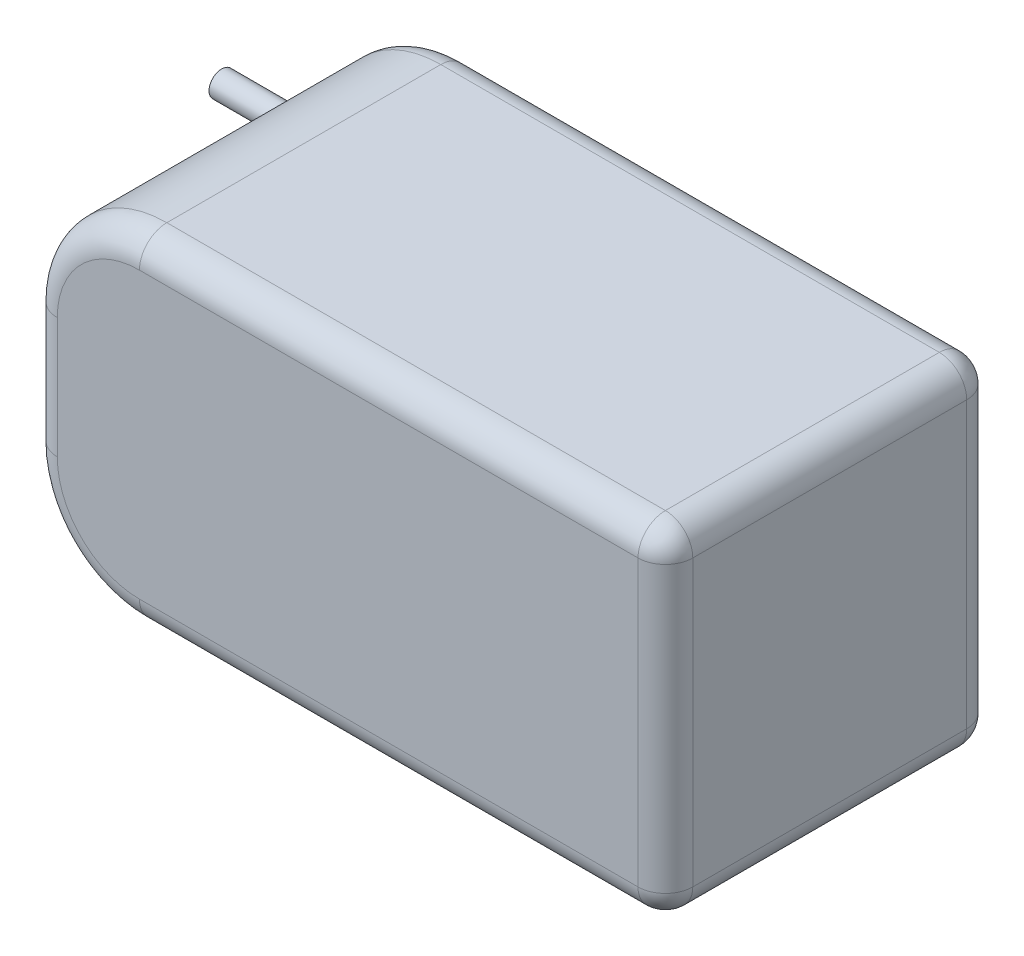
ISO-10303-21;
HEADER;
FILE_DESCRIPTION(('STEP AP214'),'2;1');
FILE_NAME('part.step','',(''),(''),'','','');
FILE_SCHEMA(('AUTOMOTIVE_DESIGN { 1 0 10303 214 1 1 1 1 }'));
ENDSEC;
DATA;
#1=APPLICATION_CONTEXT('core data for automotive mechanical design processes');
#2=APPLICATION_PROTOCOL_DEFINITION('international standard','automotive_design',2000,#1);
#3=PRODUCT_CONTEXT('',#1,'mechanical');
#4=PRODUCT('Part','Part','',(#3));
#5=PRODUCT_RELATED_PRODUCT_CATEGORY('part','',(#4));
#6=PRODUCT_DEFINITION_FORMATION('','',#4);
#7=PRODUCT_DEFINITION_CONTEXT('part definition',#1,'design');
#8=PRODUCT_DEFINITION('design','',#6,#7);
#9=PRODUCT_DEFINITION_SHAPE('','',#8);
#10=(LENGTH_UNIT() NAMED_UNIT(*) SI_UNIT(.MILLI.,.METRE.));
#11=(NAMED_UNIT(*) PLANE_ANGLE_UNIT() SI_UNIT($,.RADIAN.));
#12=(NAMED_UNIT(*) SI_UNIT($,.STERADIAN.) SOLID_ANGLE_UNIT());
#13=UNCERTAINTY_MEASURE_WITH_UNIT(LENGTH_MEASURE(1.E-05),#10,'distance_accuracy_value','');
#14=(GEOMETRIC_REPRESENTATION_CONTEXT(3) GLOBAL_UNCERTAINTY_ASSIGNED_CONTEXT((#13)) GLOBAL_UNIT_ASSIGNED_CONTEXT((#10,
#11,#12)) REPRESENTATION_CONTEXT('',''));
#15=CARTESIAN_POINT('',(0.,0.,0.));
#16=DIRECTION('',(0.,0.,1.));
#17=DIRECTION('',(1.,0.,0.));
#18=AXIS2_PLACEMENT_3D('',#15,#16,#17);
#19=CARTESIAN_POINT('',(29.,31.,-15.));
#20=DIRECTION('',(-1.,0.,0.));
#21=DIRECTION('',(0.,0.,1.));
#22=AXIS2_PLACEMENT_3D('',#19,#20,#21);
#23=PLANE('',#22);
#24=DIRECTION('',(0.,-1.,0.));
#25=VECTOR('',#24,1.);
#26=CARTESIAN_POINT('',(29.,31.,12.5));
#27=LINE('',#26,#25);
#28=CARTESIAN_POINT('',(29.,28.5,12.5));
#29=VERTEX_POINT('',#28);
#30=CARTESIAN_POINT('',(29.,2.5,12.5));
#31=VERTEX_POINT('',#30);
#32=EDGE_CURVE('E236',#29,#31,#27,.T.);
#33=ORIENTED_EDGE('',*,*,#32,.T.);
#34=DIRECTION('',(0.,0.,-1.));
#35=VECTOR('',#34,1.);
#36=CARTESIAN_POINT('',(29.,2.5,-15.));
#37=LINE('',#36,#35);
#38=CARTESIAN_POINT('',(29.,2.5,-12.5));
#39=VERTEX_POINT('',#38);
#40=EDGE_CURVE('E239',#31,#39,#37,.T.);
#41=ORIENTED_EDGE('',*,*,#40,.T.);
#42=DIRECTION('',(0.,-1.,0.));
#43=VECTOR('',#42,1.);
#44=CARTESIAN_POINT('',(29.,31.,-12.5));
#45=LINE('',#44,#43);
#46=CARTESIAN_POINT('',(29.,28.5,-12.5));
#47=VERTEX_POINT('',#46);
#48=EDGE_CURVE('E234',#39,#47,#45,.F.);
#49=ORIENTED_EDGE('',*,*,#48,.T.);
#50=DIRECTION('',(0.,0.,-1.));
#51=VECTOR('',#50,1.);
#52=CARTESIAN_POINT('',(29.,28.5,15.));
#53=LINE('',#52,#51);
#54=EDGE_CURVE('E232',#47,#29,#53,.F.);
#55=ORIENTED_EDGE('',*,*,#54,.T.);
#56=EDGE_LOOP('',(#33,#41,#49,#55));
#57=FACE_BOUND('',#56,.T.);
#58=ADVANCED_FACE('F34',(#57),#23,.F.);
#59=CARTESIAN_POINT('',(-29.,31.,-15.));
#60=DIRECTION('',(0.,0.,1.));
#61=DIRECTION('',(1.,0.,0.));
#62=AXIS2_PLACEMENT_3D('',#59,#60,#61);
#63=PLANE('',#62);
#64=DIRECTION('',(0.,-1.,0.));
#65=VECTOR('',#64,1.);
#66=CARTESIAN_POINT('',(26.5,31.,-15.));
#67=LINE('',#66,#65);
#68=CARTESIAN_POINT('',(26.5,28.5,-15.));
#69=VERTEX_POINT('',#68);
#70=CARTESIAN_POINT('',(26.5,2.5,-15.));
#71=VERTEX_POINT('',#70);
#72=EDGE_CURVE('E221',#69,#71,#67,.T.);
#73=ORIENTED_EDGE('',*,*,#72,.T.);
#74=DIRECTION('',(-1.,0.,0.));
#75=VECTOR('',#74,1.);
#76=CARTESIAN_POINT('',(-29.,2.5,-15.));
#77=LINE('',#76,#75);
#78=CARTESIAN_POINT('',(-19.,2.5,-15.));
#79=VERTEX_POINT('',#78);
#80=EDGE_CURVE('E229',#71,#79,#77,.T.);
#81=ORIENTED_EDGE('',*,*,#80,.T.);
#82=CARTESIAN_POINT('',(-19.,10.,-15.));
#83=DIRECTION('',(0.,0.,1.));
#84=DIRECTION('',(1.,0.,0.));
#85=AXIS2_PLACEMENT_3D('',#82,#83,#84);
#86=CIRCLE('',#85,7.5);
#87=CARTESIAN_POINT('',(-26.5,10.,-15.));
#88=VERTEX_POINT('',#87);
#89=EDGE_CURVE('E227',#79,#88,#86,.F.);
#90=ORIENTED_EDGE('',*,*,#89,.T.);
#91=DIRECTION('',(0.,-1.,0.));
#92=VECTOR('',#91,1.);
#93=CARTESIAN_POINT('',(-26.5,31.,-15.));
#94=LINE('',#93,#92);
#95=CARTESIAN_POINT('',(-26.5,21.,-15.));
#96=VERTEX_POINT('',#95);
#97=EDGE_CURVE('E225',#88,#96,#94,.F.);
#98=ORIENTED_EDGE('',*,*,#97,.T.);
#99=CARTESIAN_POINT('',(-19.,21.,-15.));
#100=DIRECTION('',(0.,0.,1.));
#101=DIRECTION('',(1.,0.,0.));
#102=AXIS2_PLACEMENT_3D('',#99,#100,#101);
#103=CIRCLE('',#102,7.5);
#104=CARTESIAN_POINT('',(-19.,28.5,-15.));
#105=VERTEX_POINT('',#104);
#106=EDGE_CURVE('E223',#96,#105,#103,.F.);
#107=ORIENTED_EDGE('',*,*,#106,.T.);
#108=DIRECTION('',(-1.,0.,0.));
#109=VECTOR('',#108,1.);
#110=CARTESIAN_POINT('',(29.,28.5,-15.));
#111=LINE('',#110,#109);
#112=EDGE_CURVE('E219',#105,#69,#111,.F.);
#113=ORIENTED_EDGE('',*,*,#112,.T.);
#114=EDGE_LOOP('',(#73,#81,#90,#98,#107,#113));
#115=FACE_BOUND('',#114,.T.);
#116=ADVANCED_FACE('F356',(#115),#63,.F.);
#117=CARTESIAN_POINT('',(-29.,31.,-15.));
#118=DIRECTION('',(1.,0.,0.));
#119=DIRECTION('',(0.,0.,-1.));
#120=AXIS2_PLACEMENT_3D('',#117,#118,#119);
#121=PLANE('',#120);
#122=CARTESIAN_POINT('',(-29.,19.5,-12.5));
#123=DIRECTION('',(-1.,0.,0.));
#124=DIRECTION('',(0.,0.,-1.));
#125=AXIS2_PLACEMENT_3D('',#122,#123,#124);
#126=CIRCLE('',#125,1.15);
#127=CARTESIAN_POINT('',(-29.,18.35,-12.5));
#128=VERTEX_POINT('',#127);
#129=CARTESIAN_POINT('',(-29.,20.65,-12.5));
#130=VERTEX_POINT('',#129);
#131=EDGE_CURVE('E155',#128,#130,#126,.T.);
#132=ORIENTED_EDGE('',*,*,#131,.F.);
#133=DIRECTION('',(0.,-1.,0.));
#134=VECTOR('',#133,1.);
#135=CARTESIAN_POINT('',(-29.,31.,-12.5));
#136=LINE('',#135,#134);
#137=CARTESIAN_POINT('',(-29.,12.65,-12.5));
#138=VERTEX_POINT('',#137);
#139=EDGE_CURVE('E58',#128,#138,#136,.T.);
#140=ORIENTED_EDGE('',*,*,#139,.T.);
#141=CARTESIAN_POINT('',(-29.,11.5,-12.5));
#142=DIRECTION('',(-1.,0.,0.));
#143=DIRECTION('',(0.,0.,1.));
#144=AXIS2_PLACEMENT_3D('',#141,#142,#143);
#145=CIRCLE('',#144,1.15);
#146=CARTESIAN_POINT('',(-29.,10.35,-12.5));
#147=VERTEX_POINT('',#146);
#148=EDGE_CURVE('E177',#147,#138,#145,.T.);
#149=ORIENTED_EDGE('',*,*,#148,.F.);
#150=CARTESIAN_POINT('',(-29.,10.,-12.5));
#151=VERTEX_POINT('',#150);
#152=EDGE_CURVE('E166',#147,#151,#136,.T.);
#153=ORIENTED_EDGE('',*,*,#152,.T.);
#154=DIRECTION('',(0.,0.,1.));
#155=VECTOR('',#154,1.);
#156=CARTESIAN_POINT('',(-29.,10.,-15.));
#157=LINE('',#156,#155);
#158=CARTESIAN_POINT('',(-29.,10.,12.5));
#159=VERTEX_POINT('',#158);
#160=EDGE_CURVE('E180',#151,#159,#157,.T.);
#161=ORIENTED_EDGE('',*,*,#160,.T.);
#162=DIRECTION('',(0.,-1.,0.));
#163=VECTOR('',#162,1.);
#164=CARTESIAN_POINT('',(-29.,31.,12.5));
#165=LINE('',#164,#163);
#166=CARTESIAN_POINT('',(-29.,21.,12.5));
#167=VERTEX_POINT('',#166);
#168=EDGE_CURVE('E213',#159,#167,#165,.F.);
#169=ORIENTED_EDGE('',*,*,#168,.T.);
#170=DIRECTION('',(0.,0.,1.));
#171=VECTOR('',#170,1.);
#172=CARTESIAN_POINT('',(-29.,21.,-15.));
#173=LINE('',#172,#171);
#174=CARTESIAN_POINT('',(-29.,21.,-12.5));
#175=VERTEX_POINT('',#174);
#176=EDGE_CURVE('E178',#167,#175,#173,.F.);
#177=ORIENTED_EDGE('',*,*,#176,.T.);
#178=EDGE_CURVE('E153',#175,#130,#136,.T.);
#179=ORIENTED_EDGE('',*,*,#178,.T.);
#180=EDGE_LOOP('',(#132,#140,#149,#153,#161,#169,#177,#179));
#181=FACE_BOUND('',#180,.T.);
#182=ADVANCED_FACE('F156',(#181),#121,.F.);
#183=CARTESIAN_POINT('',(-29.,31.,15.));
#184=DIRECTION('',(0.,0.,-1.));
#185=DIRECTION('',(-1.,0.,0.));
#186=AXIS2_PLACEMENT_3D('',#183,#184,#185);
#187=PLANE('',#186);
#188=CARTESIAN_POINT('',(-19.,10.,15.));
#189=DIRECTION('',(0.,0.,-1.));
#190=DIRECTION('',(-1.,0.,0.));
#191=AXIS2_PLACEMENT_3D('',#188,#189,#190);
#192=CIRCLE('',#191,7.5);
#193=CARTESIAN_POINT('',(-26.5,10.,15.));
#194=VERTEX_POINT('',#193);
#195=CARTESIAN_POINT('',(-19.,2.5,15.));
#196=VERTEX_POINT('',#195);
#197=EDGE_CURVE('E197',#194,#196,#192,.F.);
#198=ORIENTED_EDGE('',*,*,#197,.T.);
#199=DIRECTION('',(1.,0.,0.));
#200=VECTOR('',#199,1.);
#201=CARTESIAN_POINT('',(-29.,2.5,15.));
#202=LINE('',#201,#200);
#203=CARTESIAN_POINT('',(26.5,2.5,15.));
#204=VERTEX_POINT('',#203);
#205=EDGE_CURVE('E199',#196,#204,#202,.T.);
#206=ORIENTED_EDGE('',*,*,#205,.T.);
#207=DIRECTION('',(0.,-1.,0.));
#208=VECTOR('',#207,1.);
#209=CARTESIAN_POINT('',(26.5,31.,15.));
#210=LINE('',#209,#208);
#211=CARTESIAN_POINT('',(26.5,28.5,15.));
#212=VERTEX_POINT('',#211);
#213=EDGE_CURVE('E191',#204,#212,#210,.F.);
#214=ORIENTED_EDGE('',*,*,#213,.T.);
#215=DIRECTION('',(1.,0.,0.));
#216=VECTOR('',#215,1.);
#217=CARTESIAN_POINT('',(-19.,28.5,15.));
#218=LINE('',#217,#216);
#219=CARTESIAN_POINT('',(-19.,28.5,15.));
#220=VERTEX_POINT('',#219);
#221=EDGE_CURVE('E189',#212,#220,#218,.F.);
#222=ORIENTED_EDGE('',*,*,#221,.T.);
#223=CARTESIAN_POINT('',(-19.,21.,15.));
#224=DIRECTION('',(0.,0.,-1.));
#225=DIRECTION('',(-1.,0.,0.));
#226=AXIS2_PLACEMENT_3D('',#223,#224,#225);
#227=CIRCLE('',#226,7.5);
#228=CARTESIAN_POINT('',(-26.5,21.,15.));
#229=VERTEX_POINT('',#228);
#230=EDGE_CURVE('E193',#220,#229,#227,.F.);
#231=ORIENTED_EDGE('',*,*,#230,.T.);
#232=DIRECTION('',(0.,-1.,0.));
#233=VECTOR('',#232,1.);
#234=CARTESIAN_POINT('',(-26.5,31.,15.));
#235=LINE('',#234,#233);
#236=EDGE_CURVE('E195',#229,#194,#235,.T.);
#237=ORIENTED_EDGE('',*,*,#236,.T.);
#238=EDGE_LOOP('',(#198,#206,#214,#222,#231,#237));
#239=FACE_BOUND('',#238,.T.);
#240=ADVANCED_FACE('F324',(#239),#187,.F.);
#241=CARTESIAN_POINT('',(0.,31.,0.));
#242=DIRECTION('',(0.,1.,0.));
#243=DIRECTION('',(0.,0.,1.));
#244=AXIS2_PLACEMENT_3D('',#241,#242,#243);
#245=PLANE('',#244);
#246=DIRECTION('',(0.,0.,1.));
#247=VECTOR('',#246,1.);
#248=CARTESIAN_POINT('',(-19.,31.,15.));
#249=LINE('',#248,#247);
#250=CARTESIAN_POINT('',(-19.,31.,-12.5));
#251=VERTEX_POINT('',#250);
#252=CARTESIAN_POINT('',(-19.,31.,12.5));
#253=VERTEX_POINT('',#252);
#254=EDGE_CURVE('E186',#251,#253,#249,.T.);
#255=ORIENTED_EDGE('',*,*,#254,.T.);
#256=DIRECTION('',(1.,0.,0.));
#257=VECTOR('',#256,1.);
#258=CARTESIAN_POINT('',(29.,31.,12.5));
#259=LINE('',#258,#257);
#260=CARTESIAN_POINT('',(26.5,31.,12.5));
#261=VERTEX_POINT('',#260);
#262=EDGE_CURVE('E11',#253,#261,#259,.T.);
#263=ORIENTED_EDGE('',*,*,#262,.T.);
#264=DIRECTION('',(0.,0.,-1.));
#265=VECTOR('',#264,1.);
#266=CARTESIAN_POINT('',(26.5,31.,-15.));
#267=LINE('',#266,#265);
#268=CARTESIAN_POINT('',(26.5,31.,-12.5));
#269=VERTEX_POINT('',#268);
#270=EDGE_CURVE('E43',#261,#269,#267,.T.);
#271=ORIENTED_EDGE('',*,*,#270,.T.);
#272=DIRECTION('',(-1.,0.,0.));
#273=VECTOR('',#272,1.);
#274=CARTESIAN_POINT('',(-19.,31.,-12.5));
#275=LINE('',#274,#273);
#276=EDGE_CURVE('E241',#269,#251,#275,.T.);
#277=ORIENTED_EDGE('',*,*,#276,.T.);
#278=EDGE_LOOP('',(#255,#263,#271,#277));
#279=FACE_BOUND('',#278,.T.);
#280=ADVANCED_FACE('F332',(#279),#245,.T.);
#281=CARTESIAN_POINT('',(0.,0.,0.));
#282=DIRECTION('',(0.,1.,0.));
#283=DIRECTION('',(0.,0.,1.));
#284=AXIS2_PLACEMENT_3D('',#281,#282,#283);
#285=PLANE('',#284);
#286=DIRECTION('',(0.,0.,-1.));
#287=VECTOR('',#286,1.);
#288=CARTESIAN_POINT('',(26.5,0.,0.));
#289=LINE('',#288,#287);
#290=CARTESIAN_POINT('',(26.5,0.,-12.5));
#291=VERTEX_POINT('',#290);
#292=CARTESIAN_POINT('',(26.5,0.,12.5));
#293=VERTEX_POINT('',#292);
#294=EDGE_CURVE('E202',#291,#293,#289,.F.);
#295=ORIENTED_EDGE('',*,*,#294,.T.);
#296=DIRECTION('',(1.,0.,0.));
#297=VECTOR('',#296,1.);
#298=CARTESIAN_POINT('',(0.,0.,12.5));
#299=LINE('',#298,#297);
#300=CARTESIAN_POINT('',(-19.,0.,12.5));
#301=VERTEX_POINT('',#300);
#302=EDGE_CURVE('E206',#293,#301,#299,.F.);
#303=ORIENTED_EDGE('',*,*,#302,.T.);
#304=DIRECTION('',(0.,0.,1.));
#305=VECTOR('',#304,1.);
#306=CARTESIAN_POINT('',(-19.,0.,0.));
#307=LINE('',#306,#305);
#308=CARTESIAN_POINT('',(-19.,0.,-12.5));
#309=VERTEX_POINT('',#308);
#310=EDGE_CURVE('E183',#301,#309,#307,.F.);
#311=ORIENTED_EDGE('',*,*,#310,.T.);
#312=DIRECTION('',(-1.,0.,0.));
#313=VECTOR('',#312,1.);
#314=CARTESIAN_POINT('',(0.,0.,-12.5));
#315=LINE('',#314,#313);
#316=EDGE_CURVE('E204',#309,#291,#315,.F.);
#317=ORIENTED_EDGE('',*,*,#316,.T.);
#318=EDGE_LOOP('',(#295,#303,#311,#317));
#319=FACE_BOUND('',#318,.T.);
#320=ADVANCED_FACE('F372',(#319),#285,.F.);
#321=CARTESIAN_POINT('',(-19.,10.,-15.));
#322=DIRECTION('',(0.,0.,1.));
#323=DIRECTION('',(1.,0.,0.));
#324=AXIS2_PLACEMENT_3D('',#321,#322,#323);
#325=CYLINDRICAL_SURFACE('',#324,10.);
#326=ORIENTED_EDGE('',*,*,#310,.F.);
#327=CARTESIAN_POINT('',(-19.,10.,12.5));
#328=DIRECTION('',(0.,0.,-1.));
#329=DIRECTION('',(-1.,0.,0.));
#330=AXIS2_PLACEMENT_3D('',#327,#328,#329);
#331=CIRCLE('',#330,10.);
#332=EDGE_CURVE('E211',#301,#159,#331,.T.);
#333=ORIENTED_EDGE('',*,*,#332,.T.);
#334=ORIENTED_EDGE('',*,*,#160,.F.);
#335=CARTESIAN_POINT('',(-19.,10.,-12.5));
#336=DIRECTION('',(0.,0.,1.));
#337=DIRECTION('',(1.,0.,0.));
#338=AXIS2_PLACEMENT_3D('',#335,#336,#337);
#339=CIRCLE('',#338,10.);
#340=EDGE_CURVE('E209',#151,#309,#339,.T.);
#341=ORIENTED_EDGE('',*,*,#340,.T.);
#342=EDGE_LOOP('',(#326,#333,#334,#341));
#343=FACE_BOUND('',#342,.T.);
#344=ADVANCED_FACE('F370',(#343),#325,.T.);
#345=CARTESIAN_POINT('',(-19.,21.,0.));
#346=DIRECTION('',(0.,0.,-1.));
#347=DIRECTION('',(-1.,0.,0.));
#348=AXIS2_PLACEMENT_3D('',#345,#346,#347);
#349=CYLINDRICAL_SURFACE('',#348,10.);
#350=ORIENTED_EDGE('',*,*,#176,.F.);
#351=CARTESIAN_POINT('',(-19.,21.,12.5));
#352=DIRECTION('',(0.,0.,-1.));
#353=DIRECTION('',(-1.,0.,0.));
#354=AXIS2_PLACEMENT_3D('',#351,#352,#353);
#355=CIRCLE('',#354,10.);
#356=EDGE_CURVE('E217',#167,#253,#355,.T.);
#357=ORIENTED_EDGE('',*,*,#356,.T.);
#358=ORIENTED_EDGE('',*,*,#254,.F.);
#359=CARTESIAN_POINT('',(-19.,21.,-12.5));
#360=DIRECTION('',(0.,0.,1.));
#361=DIRECTION('',(1.,0.,0.));
#362=AXIS2_PLACEMENT_3D('',#359,#360,#361);
#363=CIRCLE('',#362,10.);
#364=EDGE_CURVE('E215',#251,#175,#363,.T.);
#365=ORIENTED_EDGE('',*,*,#364,.T.);
#366=EDGE_LOOP('',(#350,#357,#358,#365));
#367=FACE_BOUND('',#366,.T.);
#368=ADVANCED_FACE('F308',(#367),#349,.T.);
#369=CARTESIAN_POINT('',(-19.,21.,-12.5));
#370=DIRECTION('',(0.,0.,1.));
#371=DIRECTION('',(1.,0.,0.));
#372=AXIS2_PLACEMENT_3D('',#369,#370,#371);
#373=TOROIDAL_SURFACE('',#372,7.5,2.5);
#374=CARTESIAN_POINT('',(-26.5,21.,-12.5));
#375=DIRECTION('',(0.,-1.,0.));
#376=DIRECTION('',(0.,0.,-1.));
#377=AXIS2_PLACEMENT_3D('',#374,#375,#376);
#378=CIRCLE('',#377,2.5);
#379=EDGE_CURVE('E292',#175,#96,#378,.T.);
#380=ORIENTED_EDGE('',*,*,#379,.F.);
#381=ORIENTED_EDGE('',*,*,#364,.F.);
#382=CARTESIAN_POINT('',(-19.,28.5,-12.5));
#383=DIRECTION('',(1.,0.,0.));
#384=DIRECTION('',(0.,0.,-1.));
#385=AXIS2_PLACEMENT_3D('',#382,#383,#384);
#386=CIRCLE('',#385,2.5);
#387=EDGE_CURVE('E38',#105,#251,#386,.T.);
#388=ORIENTED_EDGE('',*,*,#387,.F.);
#389=ORIENTED_EDGE('',*,*,#106,.F.);
#390=EDGE_LOOP('',(#380,#381,#388,#389));
#391=FACE_BOUND('',#390,.T.);
#392=ADVANCED_FACE('F36',(#391),#373,.T.);
#393=CARTESIAN_POINT('',(0.,28.5,-12.5));
#394=DIRECTION('',(1.,0.,0.));
#395=DIRECTION('',(0.,0.,-1.));
#396=AXIS2_PLACEMENT_3D('',#393,#394,#395);
#397=CYLINDRICAL_SURFACE('',#396,2.5);
#398=ORIENTED_EDGE('',*,*,#387,.T.);
#399=ORIENTED_EDGE('',*,*,#276,.F.);
#400=CARTESIAN_POINT('',(26.5,28.5,-12.5));
#401=DIRECTION('',(1.,0.,0.));
#402=DIRECTION('',(0.,1.,0.));
#403=AXIS2_PLACEMENT_3D('',#400,#401,#402);
#404=CIRCLE('',#403,2.5);
#405=EDGE_CURVE('E290',#69,#269,#404,.T.);
#406=ORIENTED_EDGE('',*,*,#405,.F.);
#407=ORIENTED_EDGE('',*,*,#112,.F.);
#408=EDGE_LOOP('',(#398,#399,#406,#407));
#409=FACE_BOUND('',#408,.T.);
#410=ADVANCED_FACE('F300',(#409),#397,.T.);
#411=CARTESIAN_POINT('',(-26.5,31.,-12.5));
#412=DIRECTION('',(0.,-1.,0.));
#413=DIRECTION('',(0.,0.,-1.));
#414=AXIS2_PLACEMENT_3D('',#411,#412,#413);
#415=CYLINDRICAL_SURFACE('',#414,2.5);
#416=ORIENTED_EDGE('',*,*,#379,.T.);
#417=ORIENTED_EDGE('',*,*,#97,.F.);
#418=CARTESIAN_POINT('',(-26.5,10.,-12.5));
#419=DIRECTION('',(0.,-1.,0.));
#420=DIRECTION('',(0.,0.,-1.));
#421=AXIS2_PLACEMENT_3D('',#418,#419,#420);
#422=CIRCLE('',#421,2.5);
#423=EDGE_CURVE('E287',#151,#88,#422,.T.);
#424=ORIENTED_EDGE('',*,*,#423,.F.);
#425=ORIENTED_EDGE('',*,*,#152,.F.);
#426=EDGE_CURVE('E150',#138,#147,#136,.T.);
#427=ORIENTED_EDGE('',*,*,#426,.F.);
#428=ORIENTED_EDGE('',*,*,#139,.F.);
#429=EDGE_CURVE('E51',#130,#128,#136,.T.);
#430=ORIENTED_EDGE('',*,*,#429,.F.);
#431=ORIENTED_EDGE('',*,*,#178,.F.);
#432=EDGE_LOOP('',(#416,#417,#424,#425,#427,#428,#430,#431));
#433=FACE_BOUND('',#432,.T.);
#434=ADVANCED_FACE('F148',(#433),#415,.T.);
#435=CARTESIAN_POINT('',(26.5,28.5,-12.5));
#436=DIRECTION('',(0.,0.,1.));
#437=DIRECTION('',(1.,0.,0.));
#438=AXIS2_PLACEMENT_3D('',#435,#436,#437);
#439=SPHERICAL_SURFACE('',#438,2.5);
#440=CARTESIAN_POINT('',(26.5,28.5,-12.5));
#441=DIRECTION('',(0.,1.,0.));
#442=DIRECTION('',(0.,0.,1.));
#443=AXIS2_PLACEMENT_3D('',#440,#441,#442);
#444=CIRCLE('',#443,2.5);
#445=EDGE_CURVE('E281',#69,#47,#444,.F.);
#446=ORIENTED_EDGE('',*,*,#445,.F.);
#447=ORIENTED_EDGE('',*,*,#405,.T.);
#448=CARTESIAN_POINT('',(26.5,28.5,-12.5));
#449=DIRECTION('',(0.,0.,-1.));
#450=DIRECTION('',(-1.,0.,0.));
#451=AXIS2_PLACEMENT_3D('',#448,#449,#450);
#452=CIRCLE('',#451,2.5);
#453=EDGE_CURVE('E284',#47,#269,#452,.F.);
#454=ORIENTED_EDGE('',*,*,#453,.F.);
#455=EDGE_LOOP('',(#446,#447,#454));
#456=FACE_BOUND('',#455,.T.);
#457=ADVANCED_FACE('F348',(#456),#439,.T.);
#458=CARTESIAN_POINT('',(-19.,10.,-12.5));
#459=DIRECTION('',(0.,0.,1.));
#460=DIRECTION('',(1.,0.,0.));
#461=AXIS2_PLACEMENT_3D('',#458,#459,#460);
#462=TOROIDAL_SURFACE('',#461,7.5,2.5);
#463=ORIENTED_EDGE('',*,*,#423,.T.);
#464=ORIENTED_EDGE('',*,*,#89,.F.);
#465=CARTESIAN_POINT('',(-19.,2.5,-12.5));
#466=DIRECTION('',(1.,0.,0.));
#467=DIRECTION('',(0.,0.,-1.));
#468=AXIS2_PLACEMENT_3D('',#465,#466,#467);
#469=CIRCLE('',#468,2.5);
#470=EDGE_CURVE('E279',#309,#79,#469,.T.);
#471=ORIENTED_EDGE('',*,*,#470,.F.);
#472=ORIENTED_EDGE('',*,*,#340,.F.);
#473=EDGE_LOOP('',(#463,#464,#471,#472));
#474=FACE_BOUND('',#473,.T.);
#475=ADVANCED_FACE('F366',(#474),#462,.T.);
#476=CARTESIAN_POINT('',(0.,28.5,12.5));
#477=DIRECTION('',(-1.,0.,0.));
#478=DIRECTION('',(0.,0.,1.));
#479=AXIS2_PLACEMENT_3D('',#476,#477,#478);
#480=CYLINDRICAL_SURFACE('',#479,2.5);
#481=CARTESIAN_POINT('',(26.5,28.5,12.5));
#482=DIRECTION('',(1.,0.,0.));
#483=DIRECTION('',(0.,0.,-1.));
#484=AXIS2_PLACEMENT_3D('',#481,#482,#483);
#485=CIRCLE('',#484,2.5);
#486=EDGE_CURVE('E273',#261,#212,#485,.T.);
#487=ORIENTED_EDGE('',*,*,#486,.F.);
#488=ORIENTED_EDGE('',*,*,#262,.F.);
#489=CARTESIAN_POINT('',(-19.,28.5,12.5));
#490=DIRECTION('',(-1.,0.,0.));
#491=DIRECTION('',(0.,0.,1.));
#492=AXIS2_PLACEMENT_3D('',#489,#490,#491);
#493=CIRCLE('',#492,2.5);
#494=EDGE_CURVE('E276',#220,#253,#493,.T.);
#495=ORIENTED_EDGE('',*,*,#494,.F.);
#496=ORIENTED_EDGE('',*,*,#221,.F.);
#497=EDGE_LOOP('',(#487,#488,#495,#496));
#498=FACE_BOUND('',#497,.T.);
#499=ADVANCED_FACE('F336',(#498),#480,.T.);
#500=CARTESIAN_POINT('',(26.5,28.5,0.));
#501=DIRECTION('',(0.,0.,1.));
#502=DIRECTION('',(1.,0.,0.));
#503=AXIS2_PLACEMENT_3D('',#500,#501,#502);
#504=CYLINDRICAL_SURFACE('',#503,2.5);
#505=ORIENTED_EDGE('',*,*,#453,.T.);
#506=ORIENTED_EDGE('',*,*,#270,.F.);
#507=CARTESIAN_POINT('',(26.5,28.5,12.5));
#508=DIRECTION('',(0.,0.,1.));
#509=DIRECTION('',(0.,-1.,0.));
#510=AXIS2_PLACEMENT_3D('',#507,#508,#509);
#511=CIRCLE('',#510,2.5);
#512=EDGE_CURVE('E270',#29,#261,#511,.T.);
#513=ORIENTED_EDGE('',*,*,#512,.F.);
#514=ORIENTED_EDGE('',*,*,#54,.F.);
#515=EDGE_LOOP('',(#505,#506,#513,#514));
#516=FACE_BOUND('',#515,.T.);
#517=ADVANCED_FACE('F344',(#516),#504,.T.);
#518=CARTESIAN_POINT('',(26.5,31.,-12.5));
#519=DIRECTION('',(0.,-1.,0.));
#520=DIRECTION('',(0.,0.,-1.));
#521=AXIS2_PLACEMENT_3D('',#518,#519,#520);
#522=CYLINDRICAL_SURFACE('',#521,2.5);
#523=ORIENTED_EDGE('',*,*,#445,.T.);
#524=ORIENTED_EDGE('',*,*,#48,.F.);
#525=CARTESIAN_POINT('',(26.5,2.5,-12.5));
#526=DIRECTION('',(0.,-1.,0.));
#527=DIRECTION('',(0.,0.,-1.));
#528=AXIS2_PLACEMENT_3D('',#525,#526,#527);
#529=CIRCLE('',#528,2.5);
#530=EDGE_CURVE('E267',#71,#39,#529,.T.);
#531=ORIENTED_EDGE('',*,*,#530,.F.);
#532=ORIENTED_EDGE('',*,*,#72,.F.);
#533=EDGE_LOOP('',(#523,#524,#531,#532));
#534=FACE_BOUND('',#533,.T.);
#535=ADVANCED_FACE('F353',(#534),#522,.T.);
#536=CARTESIAN_POINT('',(-29.,2.5,-12.5));
#537=DIRECTION('',(-1.,0.,0.));
#538=DIRECTION('',(0.,0.,1.));
#539=AXIS2_PLACEMENT_3D('',#536,#537,#538);
#540=CYLINDRICAL_SURFACE('',#539,2.5);
#541=ORIENTED_EDGE('',*,*,#470,.T.);
#542=ORIENTED_EDGE('',*,*,#80,.F.);
#543=CARTESIAN_POINT('',(26.5,2.5,-12.5));
#544=DIRECTION('',(1.,0.,0.));
#545=DIRECTION('',(0.,0.,-1.));
#546=AXIS2_PLACEMENT_3D('',#543,#544,#545);
#547=CIRCLE('',#546,2.5);
#548=EDGE_CURVE('E264',#291,#71,#547,.T.);
#549=ORIENTED_EDGE('',*,*,#548,.F.);
#550=ORIENTED_EDGE('',*,*,#316,.F.);
#551=EDGE_LOOP('',(#541,#542,#549,#550));
#552=FACE_BOUND('',#551,.T.);
#553=ADVANCED_FACE('F359',(#552),#540,.T.);
#554=CARTESIAN_POINT('',(-19.,21.,12.5));
#555=DIRECTION('',(0.,0.,-1.));
#556=DIRECTION('',(-1.,0.,0.));
#557=AXIS2_PLACEMENT_3D('',#554,#555,#556);
#558=TOROIDAL_SURFACE('',#557,7.5,2.5);
#559=ORIENTED_EDGE('',*,*,#494,.T.);
#560=ORIENTED_EDGE('',*,*,#356,.F.);
#561=CARTESIAN_POINT('',(-26.5,21.,12.5));
#562=DIRECTION('',(0.,-1.,0.));
#563=DIRECTION('',(0.,0.,-1.));
#564=AXIS2_PLACEMENT_3D('',#561,#562,#563);
#565=CIRCLE('',#564,2.5);
#566=EDGE_CURVE('E261',#229,#167,#565,.T.);
#567=ORIENTED_EDGE('',*,*,#566,.F.);
#568=ORIENTED_EDGE('',*,*,#230,.F.);
#569=EDGE_LOOP('',(#559,#560,#567,#568));
#570=FACE_BOUND('',#569,.T.);
#571=ADVANCED_FACE('F329',(#570),#558,.T.);
#572=CARTESIAN_POINT('',(26.5,28.5,12.5));
#573=DIRECTION('',(0.,0.,1.));
#574=DIRECTION('',(1.,0.,0.));
#575=AXIS2_PLACEMENT_3D('',#572,#573,#574);
#576=SPHERICAL_SURFACE('',#575,2.5);
#577=ORIENTED_EDGE('',*,*,#512,.T.);
#578=ORIENTED_EDGE('',*,*,#486,.T.);
#579=CARTESIAN_POINT('',(26.5,28.5,12.5));
#580=DIRECTION('',(0.,1.,0.));
#581=DIRECTION('',(0.,0.,1.));
#582=AXIS2_PLACEMENT_3D('',#579,#580,#581);
#583=CIRCLE('',#582,2.5);
#584=EDGE_CURVE('E258',#29,#212,#583,.F.);
#585=ORIENTED_EDGE('',*,*,#584,.F.);
#586=EDGE_LOOP('',(#577,#578,#585));
#587=FACE_BOUND('',#586,.T.);
#588=ADVANCED_FACE('F340',(#587),#576,.T.);
#589=CARTESIAN_POINT('',(26.5,2.5,-12.5));
#590=DIRECTION('',(0.,0.,1.));
#591=DIRECTION('',(1.,0.,0.));
#592=AXIS2_PLACEMENT_3D('',#589,#590,#591);
#593=SPHERICAL_SURFACE('',#592,2.5);
#594=ORIENTED_EDGE('',*,*,#548,.T.);
#595=ORIENTED_EDGE('',*,*,#530,.T.);
#596=CARTESIAN_POINT('',(26.5,2.5,-12.5));
#597=DIRECTION('',(0.,0.,-1.));
#598=DIRECTION('',(-1.,0.,0.));
#599=AXIS2_PLACEMENT_3D('',#596,#597,#598);
#600=CIRCLE('',#599,2.5);
#601=EDGE_CURVE('E255',#291,#39,#600,.F.);
#602=ORIENTED_EDGE('',*,*,#601,.F.);
#603=EDGE_LOOP('',(#594,#595,#602));
#604=FACE_BOUND('',#603,.T.);
#605=ADVANCED_FACE('F388',(#604),#593,.T.);
#606=CARTESIAN_POINT('',(-26.5,31.,12.5));
#607=DIRECTION('',(0.,-1.,0.));
#608=DIRECTION('',(0.,0.,-1.));
#609=AXIS2_PLACEMENT_3D('',#606,#607,#608);
#610=CYLINDRICAL_SURFACE('',#609,2.5);
#611=ORIENTED_EDGE('',*,*,#566,.T.);
#612=ORIENTED_EDGE('',*,*,#168,.F.);
#613=CARTESIAN_POINT('',(-26.5,10.,12.5));
#614=DIRECTION('',(0.,-1.,0.));
#615=DIRECTION('',(0.,0.,-1.));
#616=AXIS2_PLACEMENT_3D('',#613,#614,#615);
#617=CIRCLE('',#616,2.5);
#618=EDGE_CURVE('E252',#194,#159,#617,.T.);
#619=ORIENTED_EDGE('',*,*,#618,.F.);
#620=ORIENTED_EDGE('',*,*,#236,.F.);
#621=EDGE_LOOP('',(#611,#612,#619,#620));
#622=FACE_BOUND('',#621,.T.);
#623=ADVANCED_FACE('F314',(#622),#610,.T.);
#624=CARTESIAN_POINT('',(26.5,31.,12.5));
#625=DIRECTION('',(0.,-1.,0.));
#626=DIRECTION('',(0.,0.,-1.));
#627=AXIS2_PLACEMENT_3D('',#624,#625,#626);
#628=CYLINDRICAL_SURFACE('',#627,2.5);
#629=ORIENTED_EDGE('',*,*,#584,.T.);
#630=ORIENTED_EDGE('',*,*,#213,.F.);
#631=CARTESIAN_POINT('',(26.5,2.5,12.5));
#632=DIRECTION('',(0.,-1.,0.));
#633=DIRECTION('',(0.,0.,-1.));
#634=AXIS2_PLACEMENT_3D('',#631,#632,#633);
#635=CIRCLE('',#634,2.5);
#636=EDGE_CURVE('E249',#31,#204,#635,.T.);
#637=ORIENTED_EDGE('',*,*,#636,.F.);
#638=ORIENTED_EDGE('',*,*,#32,.F.);
#639=EDGE_LOOP('',(#629,#630,#637,#638));
#640=FACE_BOUND('',#639,.T.);
#641=ADVANCED_FACE('F385',(#640),#628,.T.);
#642=CARTESIAN_POINT('',(26.5,2.5,-15.));
#643=DIRECTION('',(0.,0.,-1.));
#644=DIRECTION('',(-1.,0.,0.));
#645=AXIS2_PLACEMENT_3D('',#642,#643,#644);
#646=CYLINDRICAL_SURFACE('',#645,2.5);
#647=ORIENTED_EDGE('',*,*,#601,.T.);
#648=ORIENTED_EDGE('',*,*,#40,.F.);
#649=CARTESIAN_POINT('',(26.5,2.5,12.5));
#650=DIRECTION('',(0.,0.,1.));
#651=DIRECTION('',(1.,0.,0.));
#652=AXIS2_PLACEMENT_3D('',#649,#650,#651);
#653=CIRCLE('',#652,2.5);
#654=EDGE_CURVE('E247',#293,#31,#653,.T.);
#655=ORIENTED_EDGE('',*,*,#654,.F.);
#656=ORIENTED_EDGE('',*,*,#294,.F.);
#657=EDGE_LOOP('',(#647,#648,#655,#656));
#658=FACE_BOUND('',#657,.T.);
#659=ADVANCED_FACE('F390',(#658),#646,.T.);
#660=CARTESIAN_POINT('',(-19.,10.,12.5));
#661=DIRECTION('',(0.,0.,-1.));
#662=DIRECTION('',(-1.,0.,0.));
#663=AXIS2_PLACEMENT_3D('',#660,#661,#662);
#664=TOROIDAL_SURFACE('',#663,7.5,2.5);
#665=ORIENTED_EDGE('',*,*,#618,.T.);
#666=ORIENTED_EDGE('',*,*,#332,.F.);
#667=CARTESIAN_POINT('',(-19.,2.5,12.5));
#668=DIRECTION('',(1.,0.,0.));
#669=DIRECTION('',(0.,0.,-1.));
#670=AXIS2_PLACEMENT_3D('',#667,#668,#669);
#671=CIRCLE('',#670,2.5);
#672=EDGE_CURVE('E245',#196,#301,#671,.T.);
#673=ORIENTED_EDGE('',*,*,#672,.F.);
#674=ORIENTED_EDGE('',*,*,#197,.F.);
#675=EDGE_LOOP('',(#665,#666,#673,#674));
#676=FACE_BOUND('',#675,.T.);
#677=ADVANCED_FACE('F320',(#676),#664,.T.);
#678=CARTESIAN_POINT('',(26.5,2.5,12.5));
#679=DIRECTION('',(0.,0.,1.));
#680=DIRECTION('',(1.,0.,0.));
#681=AXIS2_PLACEMENT_3D('',#678,#679,#680);
#682=SPHERICAL_SURFACE('',#681,2.5);
#683=ORIENTED_EDGE('',*,*,#654,.T.);
#684=ORIENTED_EDGE('',*,*,#636,.T.);
#685=CARTESIAN_POINT('',(26.5,2.5,12.5));
#686=DIRECTION('',(1.,0.,0.));
#687=DIRECTION('',(0.,0.,-1.));
#688=AXIS2_PLACEMENT_3D('',#685,#686,#687);
#689=CIRCLE('',#688,2.5);
#690=EDGE_CURVE('E173',#293,#204,#689,.F.);
#691=ORIENTED_EDGE('',*,*,#690,.F.);
#692=EDGE_LOOP('',(#683,#684,#691));
#693=FACE_BOUND('',#692,.T.);
#694=ADVANCED_FACE('F380',(#693),#682,.T.);
#695=CARTESIAN_POINT('',(-29.,2.5,12.5));
#696=DIRECTION('',(1.,0.,0.));
#697=DIRECTION('',(0.,0.,-1.));
#698=AXIS2_PLACEMENT_3D('',#695,#696,#697);
#699=CYLINDRICAL_SURFACE('',#698,2.5);
#700=ORIENTED_EDGE('',*,*,#672,.T.);
#701=ORIENTED_EDGE('',*,*,#302,.F.);
#702=ORIENTED_EDGE('',*,*,#690,.T.);
#703=ORIENTED_EDGE('',*,*,#205,.F.);
#704=EDGE_LOOP('',(#700,#701,#702,#703));
#705=FACE_BOUND('',#704,.T.);
#706=ADVANCED_FACE('F378',(#705),#699,.T.);
#707=CARTESIAN_POINT('',(-39.,11.5,-12.5));
#708=DIRECTION('',(1.,0.,0.));
#709=DIRECTION('',(0.,0.,-1.));
#710=AXIS2_PLACEMENT_3D('',#707,#708,#709);
#711=CYLINDRICAL_SURFACE('',#710,1.15);
#712=CARTESIAN_POINT('',(-39.,11.5,-12.5));
#713=DIRECTION('',(-1.,0.,0.));
#714=DIRECTION('',(0.,0.,1.));
#715=AXIS2_PLACEMENT_3D('',#712,#713,#714);
#716=CIRCLE('',#715,1.15);
#717=CARTESIAN_POINT('',(-39.,11.5,-11.35));
#718=VERTEX_POINT('',#717);
#719=EDGE_CURVE('E170',#718,#718,#716,.T.);
#720=ORIENTED_EDGE('',*,*,#719,.F.);
#721=EDGE_LOOP('',(#720));
#722=FACE_BOUND('',#721,.T.);
#723=EDGE_CURVE('E174',#138,#147,#145,.T.);
#724=ORIENTED_EDGE('',*,*,#723,.T.);
#725=ORIENTED_EDGE('',*,*,#148,.T.);
#726=EDGE_LOOP('',(#724,#725));
#727=FACE_BOUND('',#726,.T.);
#728=ADVANCED_FACE('F413',(#722,#727),#711,.T.);
#729=CARTESIAN_POINT('',(-39.,11.5,-12.5));
#730=DIRECTION('',(-1.,0.,0.));
#731=DIRECTION('',(0.,0.,1.));
#732=AXIS2_PLACEMENT_3D('',#729,#730,#731);
#733=PLANE('',#732);
#734=ORIENTED_EDGE('',*,*,#719,.T.);
#735=EDGE_LOOP('',(#734));
#736=FACE_BOUND('',#735,.T.);
#737=ADVANCED_FACE('F430',(#736),#733,.T.);
#738=CARTESIAN_POINT('',(-29.,11.5,-12.5));
#739=DIRECTION('',(-1.,0.,0.));
#740=DIRECTION('',(0.,0.,1.));
#741=AXIS2_PLACEMENT_3D('',#738,#739,#740);
#742=PLANE('',#741);
#743=ORIENTED_EDGE('',*,*,#426,.T.);
#744=ORIENTED_EDGE('',*,*,#723,.F.);
#745=EDGE_LOOP('',(#743,#744));
#746=FACE_BOUND('',#745,.T.);
#747=ADVANCED_FACE('F439',(#746),#742,.F.);
#748=CARTESIAN_POINT('',(-29.,19.5,-12.5));
#749=DIRECTION('',(1.,0.,0.));
#750=DIRECTION('',(0.,0.,-1.));
#751=AXIS2_PLACEMENT_3D('',#748,#749,#750);
#752=PLANE('',#751);
#753=ORIENTED_EDGE('',*,*,#429,.T.);
#754=EDGE_CURVE('E162',#130,#128,#126,.T.);
#755=ORIENTED_EDGE('',*,*,#754,.F.);
#756=EDGE_LOOP('',(#753,#755));
#757=FACE_BOUND('',#756,.T.);
#758=ADVANCED_FACE('F165',(#757),#752,.T.);
#759=CARTESIAN_POINT('',(-39.,19.5,-12.5));
#760=DIRECTION('',(1.,0.,0.));
#761=DIRECTION('',(0.,0.,-1.));
#762=AXIS2_PLACEMENT_3D('',#759,#760,#761);
#763=CYLINDRICAL_SURFACE('',#762,1.15);
#764=CARTESIAN_POINT('',(-39.,19.5,-12.5));
#765=DIRECTION('',(-1.,0.,0.));
#766=DIRECTION('',(0.,0.,-1.));
#767=AXIS2_PLACEMENT_3D('',#764,#765,#766);
#768=CIRCLE('',#767,1.15);
#769=CARTESIAN_POINT('',(-39.,19.5,-13.65));
#770=VERTEX_POINT('',#769);
#771=EDGE_CURVE('E161',#770,#770,#768,.T.);
#772=ORIENTED_EDGE('',*,*,#771,.F.);
#773=EDGE_LOOP('',(#772));
#774=FACE_BOUND('',#773,.T.);
#775=ORIENTED_EDGE('',*,*,#131,.T.);
#776=ORIENTED_EDGE('',*,*,#754,.T.);
#777=EDGE_LOOP('',(#775,#776));
#778=FACE_BOUND('',#777,.T.);
#779=ADVANCED_FACE('F167',(#774,#778),#763,.T.);
#780=CARTESIAN_POINT('',(-39.,19.5,-12.5));
#781=DIRECTION('',(1.,0.,0.));
#782=DIRECTION('',(0.,0.,-1.));
#783=AXIS2_PLACEMENT_3D('',#780,#781,#782);
#784=PLANE('',#783);
#785=ORIENTED_EDGE('',*,*,#771,.T.);
#786=EDGE_LOOP('',(#785));
#787=FACE_BOUND('',#786,.T.);
#788=ADVANCED_FACE('F460',(#787),#784,.F.);
#789=CLOSED_SHELL('',(#58,#116,#182,#240,#280,#320,#344,#368,#392,#410,#434,#457,#475,#499,#517,
#535,#553,#571,#588,#605,#623,#641,#659,#677,#694,#706,#728,#737,#747,#758,#779,#788));
#790=MANIFOLD_SOLID_BREP('B2',#789);
#791=ADVANCED_BREP_SHAPE_REPRESENTATION('',(#18,#790),#14);
#792=SHAPE_DEFINITION_REPRESENTATION(#9,#791);
ENDSEC;
END-ISO-10303-21;
